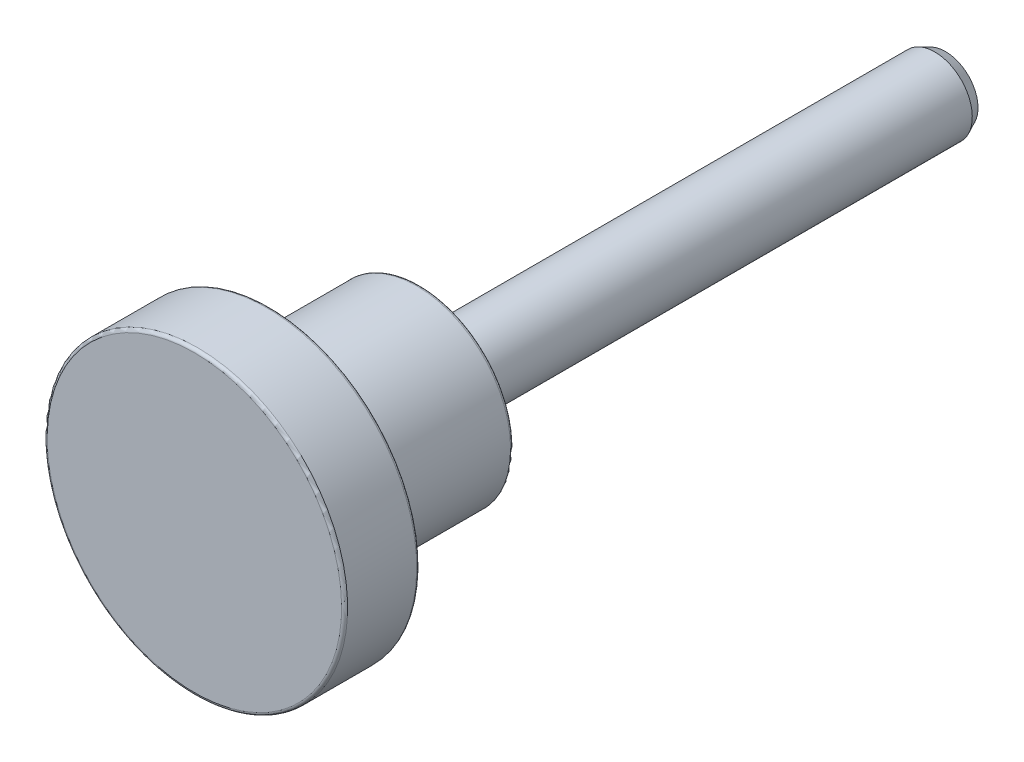
ISO-10303-21;
HEADER;
FILE_DESCRIPTION(('STEP AP214'),'2;1');
FILE_NAME('part.step','',(''),(''),'','','');
FILE_SCHEMA(('AUTOMOTIVE_DESIGN { 1 0 10303 214 1 1 1 1 }'));
ENDSEC;
DATA;
#1=APPLICATION_CONTEXT('core data for automotive mechanical design processes');
#2=APPLICATION_PROTOCOL_DEFINITION('international standard','automotive_design',2000,#1);
#3=PRODUCT_CONTEXT('',#1,'mechanical');
#4=PRODUCT('Part','Part','',(#3));
#5=PRODUCT_RELATED_PRODUCT_CATEGORY('part','',(#4));
#6=PRODUCT_DEFINITION_FORMATION('','',#4);
#7=PRODUCT_DEFINITION_CONTEXT('part definition',#1,'design');
#8=PRODUCT_DEFINITION('design','',#6,#7);
#9=PRODUCT_DEFINITION_SHAPE('','',#8);
#10=(LENGTH_UNIT() NAMED_UNIT(*) SI_UNIT(.MILLI.,.METRE.));
#11=(NAMED_UNIT(*) PLANE_ANGLE_UNIT() SI_UNIT($,.RADIAN.));
#12=(NAMED_UNIT(*) SI_UNIT($,.STERADIAN.) SOLID_ANGLE_UNIT());
#13=UNCERTAINTY_MEASURE_WITH_UNIT(LENGTH_MEASURE(1.E-05),#10,'distance_accuracy_value','');
#14=(GEOMETRIC_REPRESENTATION_CONTEXT(3) GLOBAL_UNCERTAINTY_ASSIGNED_CONTEXT((#13)) GLOBAL_UNIT_ASSIGNED_CONTEXT((#10,
#11,#12)) REPRESENTATION_CONTEXT('',''));
#15=CARTESIAN_POINT('',(0.,0.,0.));
#16=DIRECTION('',(0.,0.,1.));
#17=DIRECTION('',(1.,0.,0.));
#18=AXIS2_PLACEMENT_3D('',#15,#16,#17);
#19=CARTESIAN_POINT('',(0.,0.,8.5598));
#20=DIRECTION('',(0.,0.,-1.));
#21=DIRECTION('',(0.,1.,0.));
#22=AXIS2_PLACEMENT_3D('',#19,#20,#21);
#23=CYLINDRICAL_SURFACE('',#22,3.175);
#24=CARTESIAN_POINT('',(0.,0.,22.225));
#25=DIRECTION('',(0.,0.,1.));
#26=DIRECTION('',(0.,-1.,0.));
#27=AXIS2_PLACEMENT_3D('',#24,#25,#26);
#28=CIRCLE('',#27,3.175);
#29=CARTESIAN_POINT('',(0.,-3.175,22.225));
#30=VERTEX_POINT('',#29);
#31=EDGE_CURVE('E59',#30,#30,#28,.F.);
#32=ORIENTED_EDGE('',*,*,#31,.T.);
#33=EDGE_LOOP('',(#32));
#34=FACE_BOUND('',#33,.T.);
#35=CARTESIAN_POINT('',(0.,0.,-21.3178571428572));
#36=DIRECTION('',(0.,0.,1.));
#37=DIRECTION('',(0.,-1.,0.));
#38=AXIS2_PLACEMENT_3D('',#35,#36,#37);
#39=CIRCLE('',#38,3.175);
#40=CARTESIAN_POINT('',(0.,-3.17500000000001,-21.3178571428572));
#41=VERTEX_POINT('',#40);
#42=EDGE_CURVE('E68',#41,#41,#39,.T.);
#43=ORIENTED_EDGE('',*,*,#42,.T.);
#44=EDGE_LOOP('',(#43));
#45=FACE_BOUND('',#44,.T.);
#46=ADVANCED_FACE('F33',(#34,#45),#23,.T.);
#47=CARTESIAN_POINT('',(0.,7.9375,22.225));
#48=DIRECTION('',(0.,0.,1.));
#49=DIRECTION('',(0.,-1.,0.));
#50=AXIS2_PLACEMENT_3D('',#47,#48,#49);
#51=PLANE('',#50);
#52=CARTESIAN_POINT('',(0.,0.,22.225));
#53=DIRECTION('',(0.,0.,1.));
#54=DIRECTION('',(0.,-1.,0.));
#55=AXIS2_PLACEMENT_3D('',#52,#53,#54);
#56=CIRCLE('',#55,7.6835);
#57=CARTESIAN_POINT('',(0.,-7.6835,22.225));
#58=VERTEX_POINT('',#57);
#59=EDGE_CURVE('E53',#58,#58,#56,.F.);
#60=ORIENTED_EDGE('',*,*,#59,.T.);
#61=EDGE_LOOP('',(#60));
#62=FACE_BOUND('',#61,.T.);
#63=ORIENTED_EDGE('',*,*,#31,.F.);
#64=EDGE_LOOP('',(#63));
#65=FACE_BOUND('',#64,.T.);
#66=ADVANCED_FACE('F89',(#62,#65),#51,.F.);
#67=CARTESIAN_POINT('',(0.,0.,22.225));
#68=DIRECTION('',(0.,0.,1.));
#69=DIRECTION('',(0.,-1.,0.));
#70=AXIS2_PLACEMENT_3D('',#67,#68,#69);
#71=CYLINDRICAL_SURFACE('',#70,7.9375);
#72=CARTESIAN_POINT('',(0.,0.,22.479));
#73=DIRECTION('',(0.,0.,1.));
#74=DIRECTION('',(0.,-1.,0.));
#75=AXIS2_PLACEMENT_3D('',#72,#73,#74);
#76=CIRCLE('',#75,7.9375);
#77=CARTESIAN_POINT('',(0.,-7.9375,22.479));
#78=VERTEX_POINT('',#77);
#79=EDGE_CURVE('E56',#78,#78,#76,.T.);
#80=ORIENTED_EDGE('',*,*,#79,.T.);
#81=EDGE_LOOP('',(#80));
#82=FACE_BOUND('',#81,.T.);
#83=CARTESIAN_POINT('',(0.,0.,34.925));
#84=DIRECTION('',(0.,0.,1.));
#85=DIRECTION('',(0.,-1.,0.));
#86=AXIS2_PLACEMENT_3D('',#83,#84,#85);
#87=CIRCLE('',#86,7.9375);
#88=CARTESIAN_POINT('',(0.,-7.9375,34.925));
#89=VERTEX_POINT('',#88);
#90=EDGE_CURVE('E62',#89,#89,#87,.T.);
#91=ORIENTED_EDGE('',*,*,#90,.F.);
#92=EDGE_LOOP('',(#91));
#93=FACE_BOUND('',#92,.T.);
#94=ADVANCED_FACE('F95',(#82,#93),#71,.T.);
#95=CARTESIAN_POINT('',(0.,7.9375,34.925));
#96=DIRECTION('',(0.,0.,1.));
#97=DIRECTION('',(0.,-1.,0.));
#98=AXIS2_PLACEMENT_3D('',#95,#96,#97);
#99=PLANE('',#98);
#100=CARTESIAN_POINT('',(0.,0.,34.925));
#101=DIRECTION('',(0.,0.,1.));
#102=DIRECTION('',(0.,-1.,0.));
#103=AXIS2_PLACEMENT_3D('',#100,#101,#102);
#104=CIRCLE('',#103,12.446);
#105=CARTESIAN_POINT('',(0.,-12.446,34.925));
#106=VERTEX_POINT('',#105);
#107=EDGE_CURVE('E40',#106,#106,#104,.F.);
#108=ORIENTED_EDGE('',*,*,#107,.T.);
#109=EDGE_LOOP('',(#108));
#110=FACE_BOUND('',#109,.T.);
#111=ORIENTED_EDGE('',*,*,#90,.T.);
#112=EDGE_LOOP('',(#111));
#113=FACE_BOUND('',#112,.T.);
#114=ADVANCED_FACE('F114',(#110,#113),#99,.F.);
#115=CARTESIAN_POINT('',(0.,0.,22.225));
#116=DIRECTION('',(0.,0.,1.));
#117=DIRECTION('',(0.,-1.,0.));
#118=AXIS2_PLACEMENT_3D('',#115,#116,#117);
#119=CYLINDRICAL_SURFACE('',#118,12.7);
#120=CARTESIAN_POINT('',(0.,0.,35.179));
#121=DIRECTION('',(0.,0.,1.));
#122=DIRECTION('',(0.,-1.,0.));
#123=AXIS2_PLACEMENT_3D('',#120,#121,#122);
#124=CIRCLE('',#123,12.7);
#125=CARTESIAN_POINT('',(0.,-12.7,35.179));
#126=VERTEX_POINT('',#125);
#127=EDGE_CURVE('E44',#126,#126,#124,.T.);
#128=ORIENTED_EDGE('',*,*,#127,.T.);
#129=EDGE_LOOP('',(#128));
#130=FACE_BOUND('',#129,.T.);
#131=CARTESIAN_POINT('',(0.,0.,41.021));
#132=DIRECTION('',(0.,0.,-1.));
#133=DIRECTION('',(0.,1.,0.));
#134=AXIS2_PLACEMENT_3D('',#131,#132,#133);
#135=CIRCLE('',#134,12.7);
#136=CARTESIAN_POINT('',(0.,12.7,41.021));
#137=VERTEX_POINT('',#136);
#138=EDGE_CURVE('E48',#137,#137,#135,.T.);
#139=ORIENTED_EDGE('',*,*,#138,.T.);
#140=EDGE_LOOP('',(#139));
#141=FACE_BOUND('',#140,.T.);
#142=ADVANCED_FACE('F86',(#130,#141),#119,.T.);
#143=CARTESIAN_POINT('',(0.,12.7,41.275));
#144=DIRECTION('',(0.,0.,-1.));
#145=DIRECTION('',(0.,1.,0.));
#146=AXIS2_PLACEMENT_3D('',#143,#144,#145);
#147=PLANE('',#146);
#148=CARTESIAN_POINT('',(0.,0.,41.275));
#149=DIRECTION('',(0.,0.,-1.));
#150=DIRECTION('',(0.,1.,0.));
#151=AXIS2_PLACEMENT_3D('',#148,#149,#150);
#152=CIRCLE('',#151,12.446);
#153=CARTESIAN_POINT('',(0.,12.446,41.275));
#154=VERTEX_POINT('',#153);
#155=EDGE_CURVE('E11',#154,#154,#152,.F.);
#156=ORIENTED_EDGE('',*,*,#155,.T.);
#157=EDGE_LOOP('',(#156));
#158=FACE_BOUND('',#157,.T.);
#159=ADVANCED_FACE('F76',(#158),#147,.F.);
#160=CARTESIAN_POINT('',(0.,0.,-21.3178571428572));
#161=DIRECTION('',(0.,0.,1.));
#162=DIRECTION('',(0.,-1.,0.));
#163=AXIS2_PLACEMENT_3D('',#160,#161,#162);
#164=CONICAL_SURFACE('',#163,3.175,0.436332312998576);
#165=CARTESIAN_POINT('',(0.,0.,-22.225));
#166=DIRECTION('',(0.,0.,1.));
#167=DIRECTION('',(0.,-1.,0.));
#168=AXIS2_PLACEMENT_3D('',#165,#166,#167);
#169=CIRCLE('',#168,2.75199233867369);
#170=CARTESIAN_POINT('',(0.,-2.75199233867369,-22.225));
#171=VERTEX_POINT('',#170);
#172=EDGE_CURVE('E65',#171,#171,#169,.T.);
#173=ORIENTED_EDGE('',*,*,#172,.T.);
#174=EDGE_LOOP('',(#173));
#175=FACE_BOUND('',#174,.T.);
#176=ORIENTED_EDGE('',*,*,#42,.F.);
#177=EDGE_LOOP('',(#176));
#178=FACE_BOUND('',#177,.T.);
#179=ADVANCED_FACE('F73',(#175,#178),#164,.T.);
#180=CARTESIAN_POINT('',(0.,3.175,-22.225));
#181=DIRECTION('',(0.,0.,-1.));
#182=DIRECTION('',(0.,1.,0.));
#183=AXIS2_PLACEMENT_3D('',#180,#181,#182);
#184=PLANE('',#183);
#185=ORIENTED_EDGE('',*,*,#172,.F.);
#186=EDGE_LOOP('',(#185));
#187=FACE_BOUND('',#186,.T.);
#188=ADVANCED_FACE('F75',(#187),#184,.T.);
#189=CARTESIAN_POINT('',(0.,0.,22.479));
#190=DIRECTION('',(0.,0.,1.));
#191=DIRECTION('',(0.,-1.,0.));
#192=AXIS2_PLACEMENT_3D('',#189,#190,#191);
#193=TOROIDAL_SURFACE('',#192,7.6835,0.254);
#194=ORIENTED_EDGE('',*,*,#59,.F.);
#195=EDGE_LOOP('',(#194));
#196=FACE_BOUND('',#195,.T.);
#197=ORIENTED_EDGE('',*,*,#79,.F.);
#198=EDGE_LOOP('',(#197));
#199=FACE_BOUND('',#198,.T.);
#200=ADVANCED_FACE('F83',(#196,#199),#193,.T.);
#201=CARTESIAN_POINT('',(0.,0.,35.179));
#202=DIRECTION('',(0.,0.,1.));
#203=DIRECTION('',(0.,-1.,0.));
#204=AXIS2_PLACEMENT_3D('',#201,#202,#203);
#205=TOROIDAL_SURFACE('',#204,12.446,0.254);
#206=ORIENTED_EDGE('',*,*,#107,.F.);
#207=EDGE_LOOP('',(#206));
#208=FACE_BOUND('',#207,.T.);
#209=ORIENTED_EDGE('',*,*,#127,.F.);
#210=EDGE_LOOP('',(#209));
#211=FACE_BOUND('',#210,.T.);
#212=ADVANCED_FACE('F101',(#208,#211),#205,.T.);
#213=CARTESIAN_POINT('',(0.,0.,41.021));
#214=DIRECTION('',(0.,0.,-1.));
#215=DIRECTION('',(0.,1.,0.));
#216=AXIS2_PLACEMENT_3D('',#213,#214,#215);
#217=TOROIDAL_SURFACE('',#216,12.446,0.254);
#218=ORIENTED_EDGE('',*,*,#138,.F.);
#219=EDGE_LOOP('',(#218));
#220=FACE_BOUND('',#219,.T.);
#221=ORIENTED_EDGE('',*,*,#155,.F.);
#222=EDGE_LOOP('',(#221));
#223=FACE_BOUND('',#222,.T.);
#224=ADVANCED_FACE('F35',(#220,#223),#217,.T.);
#225=CLOSED_SHELL('',(#46,#66,#94,#114,#142,#159,#179,#188,#200,#212,#224));
#226=MANIFOLD_SOLID_BREP('B2',#225);
#227=ADVANCED_BREP_SHAPE_REPRESENTATION('',(#18,#226),#14);
#228=SHAPE_DEFINITION_REPRESENTATION(#9,#227);
ENDSEC;
END-ISO-10303-21;
